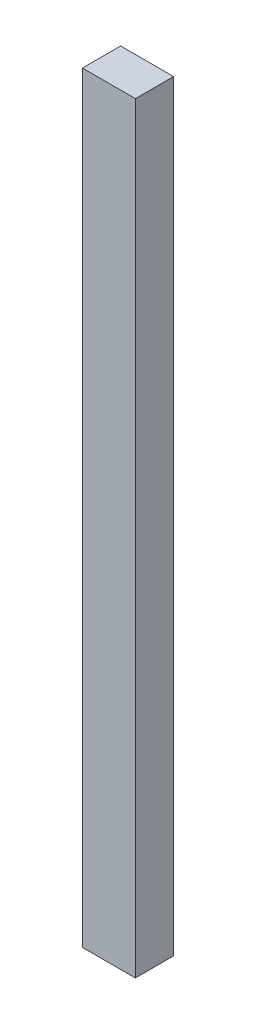
ISO-10303-21;
HEADER;
FILE_DESCRIPTION(('STEP AP214'),'2;1');
FILE_NAME('part.step','',(''),(''),'','','');
FILE_SCHEMA(('AUTOMOTIVE_DESIGN { 1 0 10303 214 1 1 1 1 }'));
ENDSEC;
DATA;
#1=APPLICATION_CONTEXT('core data for automotive mechanical design processes');
#2=APPLICATION_PROTOCOL_DEFINITION('international standard','automotive_design',2000,#1);
#3=PRODUCT_CONTEXT('',#1,'mechanical');
#4=PRODUCT('Part','Part','',(#3));
#5=PRODUCT_RELATED_PRODUCT_CATEGORY('part','',(#4));
#6=PRODUCT_DEFINITION_FORMATION('','',#4);
#7=PRODUCT_DEFINITION_CONTEXT('part definition',#1,'design');
#8=PRODUCT_DEFINITION('design','',#6,#7);
#9=PRODUCT_DEFINITION_SHAPE('','',#8);
#10=(LENGTH_UNIT() NAMED_UNIT(*) SI_UNIT(.MILLI.,.METRE.));
#11=(NAMED_UNIT(*) PLANE_ANGLE_UNIT() SI_UNIT($,.RADIAN.));
#12=(NAMED_UNIT(*) SI_UNIT($,.STERADIAN.) SOLID_ANGLE_UNIT());
#13=UNCERTAINTY_MEASURE_WITH_UNIT(LENGTH_MEASURE(1.E-05),#10,'distance_accuracy_value','');
#14=(GEOMETRIC_REPRESENTATION_CONTEXT(3) GLOBAL_UNCERTAINTY_ASSIGNED_CONTEXT((#13)) GLOBAL_UNIT_ASSIGNED_CONTEXT((#10,
#11,#12)) REPRESENTATION_CONTEXT('',''));
#15=CARTESIAN_POINT('',(0.,0.,0.));
#16=DIRECTION('',(0.,0.,1.));
#17=DIRECTION('',(1.,0.,0.));
#18=AXIS2_PLACEMENT_3D('',#15,#16,#17);
#19=CARTESIAN_POINT('',(72.0161204121903,65.7791772221511,-39.1));
#20=DIRECTION('',(0.,0.,1.));
#21=DIRECTION('',(1.,0.,0.));
#22=AXIS2_PLACEMENT_3D('',#19,#20,#21);
#23=PLANE('',#22);
#24=DIRECTION('',(1.,0.,0.));
#25=VECTOR('',#24,1.);
#26=CARTESIAN_POINT('',(72.0161204121903,67.7736293719411,-39.1));
#27=LINE('',#26,#25);
#28=CARTESIAN_POINT('',(72.1548166673903,67.7736293719411,-39.1));
#29=VERTEX_POINT('',#28);
#30=CARTESIAN_POINT('',(72.0161204121903,67.7736293719411,-39.1));
#31=VERTEX_POINT('',#30);
#32=EDGE_CURVE('E20',#29,#31,#27,.F.);
#33=ORIENTED_EDGE('',*,*,#32,.F.);
#34=DIRECTION('',(0.,1.,0.));
#35=VECTOR('',#34,1.);
#36=CARTESIAN_POINT('',(72.1548166673903,65.7791772221511,-39.1));
#37=LINE('',#36,#35);
#38=CARTESIAN_POINT('',(72.1548166673903,65.7791772221511,-39.1));
#39=VERTEX_POINT('',#38);
#40=EDGE_CURVE('E69',#29,#39,#37,.F.);
#41=ORIENTED_EDGE('',*,*,#40,.T.);
#42=DIRECTION('',(1.,0.,0.));
#43=VECTOR('',#42,1.);
#44=CARTESIAN_POINT('',(72.0161204121903,65.7791772221511,-39.1));
#45=LINE('',#44,#43);
#46=CARTESIAN_POINT('',(72.0161204121903,65.7791772221511,-39.1));
#47=VERTEX_POINT('',#46);
#48=EDGE_CURVE('E56',#39,#47,#45,.F.);
#49=ORIENTED_EDGE('',*,*,#48,.T.);
#50=DIRECTION('',(0.,1.,0.));
#51=VECTOR('',#50,1.);
#52=CARTESIAN_POINT('',(72.0161204121903,67.7736293719411,-39.1));
#53=LINE('',#52,#51);
#54=EDGE_CURVE('E62',#47,#31,#53,.T.);
#55=ORIENTED_EDGE('',*,*,#54,.T.);
#56=EDGE_LOOP('',(#33,#41,#49,#55));
#57=FACE_BOUND('',#56,.T.);
#58=ADVANCED_FACE('F17',(#57),#23,.F.);
#59=CARTESIAN_POINT('',(72.0161204121903,67.7736293719411,-39.));
#60=DIRECTION('',(1.,0.,0.));
#61=DIRECTION('',(0.,0.,-1.));
#62=AXIS2_PLACEMENT_3D('',#59,#60,#61);
#63=PLANE('',#62);
#64=DIRECTION('',(0.,0.,1.));
#65=VECTOR('',#64,1.);
#66=CARTESIAN_POINT('',(72.0161204121903,65.7791772221511,-39.));
#67=LINE('',#66,#65);
#68=CARTESIAN_POINT('',(72.0161204121903,65.7791772221511,-39.));
#69=VERTEX_POINT('',#68);
#70=EDGE_CURVE('E64',#47,#69,#67,.T.);
#71=ORIENTED_EDGE('',*,*,#70,.T.);
#72=DIRECTION('',(0.,1.,0.));
#73=VECTOR('',#72,1.);
#74=CARTESIAN_POINT('',(72.0161204121903,65.7791772221511,-39.));
#75=LINE('',#74,#73);
#76=CARTESIAN_POINT('',(72.0161204121903,67.7736293719411,-39.));
#77=VERTEX_POINT('',#76);
#78=EDGE_CURVE('E83',#77,#69,#75,.F.);
#79=ORIENTED_EDGE('',*,*,#78,.F.);
#80=DIRECTION('',(0.,0.,-1.));
#81=VECTOR('',#80,1.);
#82=CARTESIAN_POINT('',(72.0161204121903,67.7736293719411,-39.));
#83=LINE('',#82,#81);
#84=EDGE_CURVE('E67',#77,#31,#83,.T.);
#85=ORIENTED_EDGE('',*,*,#84,.T.);
#86=ORIENTED_EDGE('',*,*,#54,.F.);
#87=EDGE_LOOP('',(#71,#79,#85,#86));
#88=FACE_BOUND('',#87,.T.);
#89=ADVANCED_FACE('F63',(#88),#63,.F.);
#90=CARTESIAN_POINT('',(72.0161204121903,65.7791772221511,-39.));
#91=DIRECTION('',(0.,1.,0.));
#92=DIRECTION('',(0.,0.,1.));
#93=AXIS2_PLACEMENT_3D('',#90,#91,#92);
#94=PLANE('',#93);
#95=DIRECTION('',(0.,0.,1.));
#96=VECTOR('',#95,1.);
#97=CARTESIAN_POINT('',(72.1548166673903,65.7791772221511,-39.));
#98=LINE('',#97,#96);
#99=CARTESIAN_POINT('',(72.1548166673903,65.7791772221511,-39.));
#100=VERTEX_POINT('',#99);
#101=EDGE_CURVE('E71',#39,#100,#98,.T.);
#102=ORIENTED_EDGE('',*,*,#101,.T.);
#103=DIRECTION('',(1.,0.,0.));
#104=VECTOR('',#103,1.);
#105=CARTESIAN_POINT('',(72.0161204121903,65.7791772221511,-39.));
#106=LINE('',#105,#104);
#107=EDGE_CURVE('E75',#69,#100,#106,.T.);
#108=ORIENTED_EDGE('',*,*,#107,.F.);
#109=ORIENTED_EDGE('',*,*,#70,.F.);
#110=ORIENTED_EDGE('',*,*,#48,.F.);
#111=EDGE_LOOP('',(#102,#108,#109,#110));
#112=FACE_BOUND('',#111,.T.);
#113=ADVANCED_FACE('F73',(#112),#94,.F.);
#114=CARTESIAN_POINT('',(72.1548166673903,65.7791772221511,-39.));
#115=DIRECTION('',(-1.,0.,0.));
#116=DIRECTION('',(0.,0.,1.));
#117=AXIS2_PLACEMENT_3D('',#114,#115,#116);
#118=PLANE('',#117);
#119=DIRECTION('',(0.,0.,-1.));
#120=VECTOR('',#119,1.);
#121=CARTESIAN_POINT('',(72.1548166673903,67.7736293719411,-39.));
#122=LINE('',#121,#120);
#123=CARTESIAN_POINT('',(72.1548166673903,67.7736293719411,-39.));
#124=VERTEX_POINT('',#123);
#125=EDGE_CURVE('E35',#29,#124,#122,.F.);
#126=ORIENTED_EDGE('',*,*,#125,.T.);
#127=DIRECTION('',(0.,1.,0.));
#128=VECTOR('',#127,1.);
#129=CARTESIAN_POINT('',(72.1548166673903,65.7791772221511,-39.));
#130=LINE('',#129,#128);
#131=EDGE_CURVE('E26',#100,#124,#130,.T.);
#132=ORIENTED_EDGE('',*,*,#131,.F.);
#133=ORIENTED_EDGE('',*,*,#101,.F.);
#134=ORIENTED_EDGE('',*,*,#40,.F.);
#135=EDGE_LOOP('',(#126,#132,#133,#134));
#136=FACE_BOUND('',#135,.T.);
#137=ADVANCED_FACE('F89',(#136),#118,.F.);
#138=CARTESIAN_POINT('',(72.1548166673903,67.7736293719411,-39.));
#139=DIRECTION('',(0.,-1.,0.));
#140=DIRECTION('',(0.,0.,-1.));
#141=AXIS2_PLACEMENT_3D('',#138,#139,#140);
#142=PLANE('',#141);
#143=ORIENTED_EDGE('',*,*,#84,.F.);
#144=DIRECTION('',(1.,0.,0.));
#145=VECTOR('',#144,1.);
#146=CARTESIAN_POINT('',(72.0161204121903,67.7736293719411,-39.));
#147=LINE('',#146,#145);
#148=EDGE_CURVE('E11',#124,#77,#147,.F.);
#149=ORIENTED_EDGE('',*,*,#148,.F.);
#150=ORIENTED_EDGE('',*,*,#125,.F.);
#151=ORIENTED_EDGE('',*,*,#32,.T.);
#152=EDGE_LOOP('',(#143,#149,#150,#151));
#153=FACE_BOUND('',#152,.T.);
#154=ADVANCED_FACE('F91',(#153),#142,.F.);
#155=CARTESIAN_POINT('',(72.0161204121903,65.7791772221511,-39.));
#156=DIRECTION('',(0.,0.,1.));
#157=DIRECTION('',(1.,0.,0.));
#158=AXIS2_PLACEMENT_3D('',#155,#156,#157);
#159=PLANE('',#158);
#160=ORIENTED_EDGE('',*,*,#131,.T.);
#161=ORIENTED_EDGE('',*,*,#148,.T.);
#162=ORIENTED_EDGE('',*,*,#78,.T.);
#163=ORIENTED_EDGE('',*,*,#107,.T.);
#164=EDGE_LOOP('',(#160,#161,#162,#163));
#165=FACE_BOUND('',#164,.T.);
#166=ADVANCED_FACE('F88',(#165),#159,.T.);
#167=CLOSED_SHELL('',(#58,#89,#113,#137,#154,#166));
#168=MANIFOLD_SOLID_BREP('B1',#167);
#169=ADVANCED_BREP_SHAPE_REPRESENTATION('',(#18,#168),#14);
#170=SHAPE_DEFINITION_REPRESENTATION(#9,#169);
ENDSEC;
END-ISO-10303-21;
